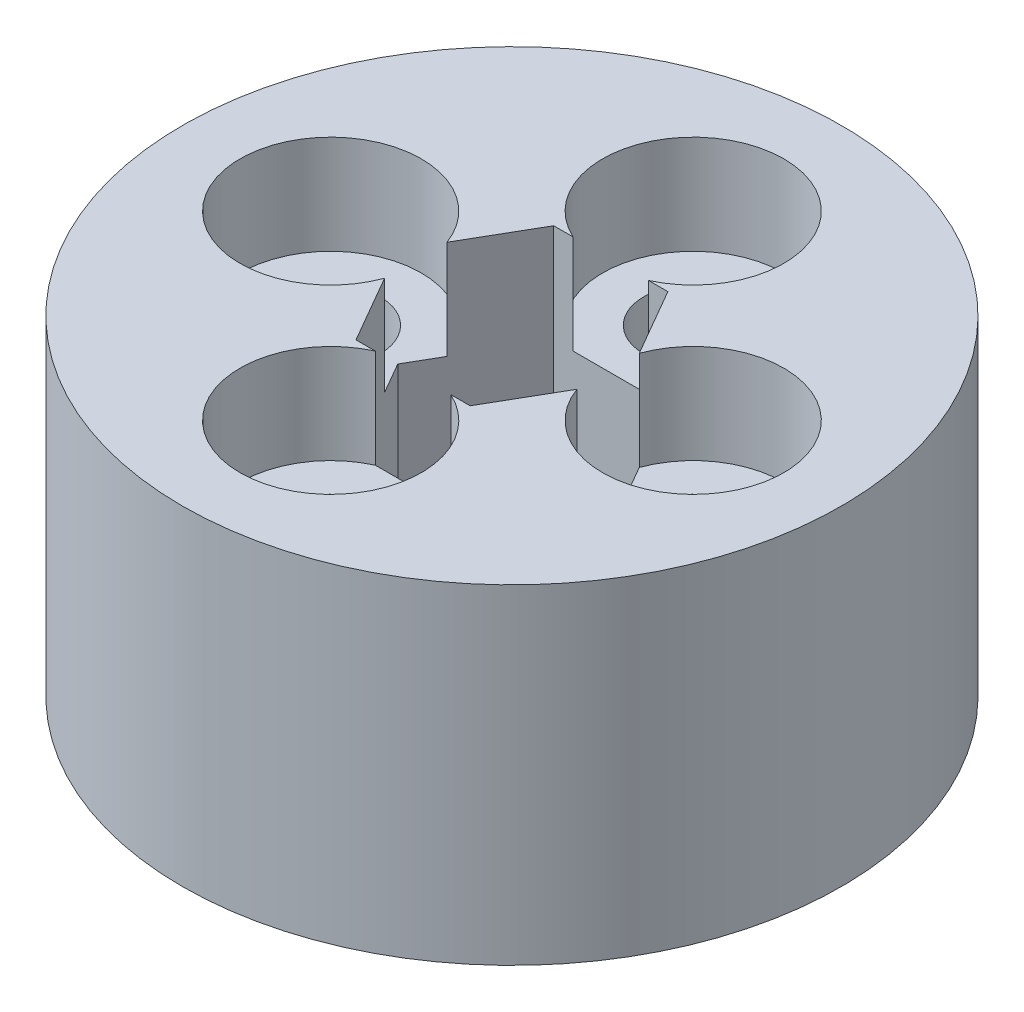
ISO-10303-21;
HEADER;
FILE_DESCRIPTION(('STEP AP214'),'2;1');
FILE_NAME('part.step','',(''),(''),'','','');
FILE_SCHEMA(('AUTOMOTIVE_DESIGN { 1 0 10303 214 1 1 1 1 }'));
ENDSEC;
DATA;
#1=APPLICATION_CONTEXT('core data for automotive mechanical design processes');
#2=APPLICATION_PROTOCOL_DEFINITION('international standard','automotive_design',2000,#1);
#3=PRODUCT_CONTEXT('',#1,'mechanical');
#4=PRODUCT('Part','Part','',(#3));
#5=PRODUCT_RELATED_PRODUCT_CATEGORY('part','',(#4));
#6=PRODUCT_DEFINITION_FORMATION('','',#4);
#7=PRODUCT_DEFINITION_CONTEXT('part definition',#1,'design');
#8=PRODUCT_DEFINITION('design','',#6,#7);
#9=PRODUCT_DEFINITION_SHAPE('','',#8);
#10=(LENGTH_UNIT() NAMED_UNIT(*) SI_UNIT(.MILLI.,.METRE.));
#11=(NAMED_UNIT(*) PLANE_ANGLE_UNIT() SI_UNIT($,.RADIAN.));
#12=(NAMED_UNIT(*) SI_UNIT($,.STERADIAN.) SOLID_ANGLE_UNIT());
#13=UNCERTAINTY_MEASURE_WITH_UNIT(LENGTH_MEASURE(1.E-05),#10,'distance_accuracy_value','');
#14=(GEOMETRIC_REPRESENTATION_CONTEXT(3) GLOBAL_UNCERTAINTY_ASSIGNED_CONTEXT((#13)) GLOBAL_UNIT_ASSIGNED_CONTEXT((#10,
#11,#12)) REPRESENTATION_CONTEXT('',''));
#15=CARTESIAN_POINT('',(0.,0.,0.));
#16=DIRECTION('',(0.,0.,1.));
#17=DIRECTION('',(1.,0.,0.));
#18=AXIS2_PLACEMENT_3D('',#15,#16,#17);
#19=CARTESIAN_POINT('',(0.,10.,-5.5));
#20=DIRECTION('',(0.,-1.,0.));
#21=DIRECTION('',(0.,0.,-1.));
#22=AXIS2_PLACEMENT_3D('',#19,#20,#21);
#23=CYLINDRICAL_SURFACE('',#22,1.5);
#24=CARTESIAN_POINT('',(0.,0.,-5.5));
#25=DIRECTION('',(0.,1.,0.));
#26=DIRECTION('',(0.,0.,1.));
#27=AXIS2_PLACEMENT_3D('',#24,#25,#26);
#28=CIRCLE('',#27,1.5);
#29=CARTESIAN_POINT('',(0.,0.,-4.));
#30=VERTEX_POINT('',#29);
#31=EDGE_CURVE('E253',#30,#30,#28,.T.);
#32=ORIENTED_EDGE('',*,*,#31,.F.);
#33=EDGE_LOOP('',(#32));
#34=FACE_BOUND('',#33,.T.);
#35=CARTESIAN_POINT('',(0.,7.,-5.5));
#36=DIRECTION('',(0.,1.,0.));
#37=DIRECTION('',(0.,0.,1.));
#38=AXIS2_PLACEMENT_3D('',#35,#36,#37);
#39=CIRCLE('',#38,1.5);
#40=CARTESIAN_POINT('',(0.,7.,-4.));
#41=VERTEX_POINT('',#40);
#42=EDGE_CURVE('E247',#41,#41,#39,.T.);
#43=ORIENTED_EDGE('',*,*,#42,.T.);
#44=EDGE_LOOP('',(#43));
#45=FACE_BOUND('',#44,.T.);
#46=ADVANCED_FACE('F37',(#34,#45),#23,.F.);
#47=CARTESIAN_POINT('',(5.50000000000015,10.,-1.55309068257925E-13));
#48=DIRECTION('',(0.,-1.,0.));
#49=DIRECTION('',(0.,0.,-1.));
#50=AXIS2_PLACEMENT_3D('',#47,#48,#49);
#51=CYLINDRICAL_SURFACE('',#50,1.50000000000012);
#52=CARTESIAN_POINT('',(5.50000000000015,0.,-1.55309068257925E-13));
#53=DIRECTION('',(0.,1.,0.));
#54=DIRECTION('',(0.,0.,1.));
#55=AXIS2_PLACEMENT_3D('',#52,#53,#54);
#56=CIRCLE('',#55,1.50000000000012);
#57=CARTESIAN_POINT('',(5.50000000000015,0.,1.49999999999997));
#58=VERTEX_POINT('',#57);
#59=EDGE_CURVE('E250',#58,#58,#56,.T.);
#60=ORIENTED_EDGE('',*,*,#59,.F.);
#61=EDGE_LOOP('',(#60));
#62=FACE_BOUND('',#61,.T.);
#63=CARTESIAN_POINT('',(5.50000000000015,7.,-1.55309068257925E-13));
#64=DIRECTION('',(0.,1.,0.));
#65=DIRECTION('',(0.,0.,1.));
#66=AXIS2_PLACEMENT_3D('',#63,#64,#65);
#67=CIRCLE('',#66,1.50000000000012);
#68=CARTESIAN_POINT('',(5.50000000000015,7.,1.49999999999997));
#69=VERTEX_POINT('',#68);
#70=EDGE_CURVE('E268',#69,#69,#67,.T.);
#71=ORIENTED_EDGE('',*,*,#70,.T.);
#72=EDGE_LOOP('',(#71));
#73=FACE_BOUND('',#72,.T.);
#74=ADVANCED_FACE('F332',(#62,#73),#51,.F.);
#75=CARTESIAN_POINT('',(3.10618136515851E-13,10.,5.5));
#76=DIRECTION('',(0.,-1.,0.));
#77=DIRECTION('',(0.,0.,-1.));
#78=AXIS2_PLACEMENT_3D('',#75,#76,#77);
#79=CYLINDRICAL_SURFACE('',#78,1.50000000000033);
#80=CARTESIAN_POINT('',(3.10618136515851E-13,0.,5.5));
#81=DIRECTION('',(0.,1.,0.));
#82=DIRECTION('',(0.,0.,1.));
#83=AXIS2_PLACEMENT_3D('',#80,#81,#82);
#84=CIRCLE('',#83,1.50000000000033);
#85=CARTESIAN_POINT('',(3.10618136515851E-13,0.,7.00000000000033));
#86=VERTEX_POINT('',#85);
#87=EDGE_CURVE('E246',#86,#86,#84,.T.);
#88=ORIENTED_EDGE('',*,*,#87,.F.);
#89=EDGE_LOOP('',(#88));
#90=FACE_BOUND('',#89,.T.);
#91=CARTESIAN_POINT('',(3.10618136515851E-13,7.,5.5));
#92=DIRECTION('',(0.,1.,0.));
#93=DIRECTION('',(0.,0.,1.));
#94=AXIS2_PLACEMENT_3D('',#91,#92,#93);
#95=CIRCLE('',#94,1.50000000000033);
#96=CARTESIAN_POINT('',(3.10618136515851E-13,7.,7.00000000000033));
#97=VERTEX_POINT('',#96);
#98=EDGE_CURVE('E265',#97,#97,#95,.T.);
#99=ORIENTED_EDGE('',*,*,#98,.T.);
#100=EDGE_LOOP('',(#99));
#101=FACE_BOUND('',#100,.T.);
#102=ADVANCED_FACE('F338',(#90,#101),#79,.F.);
#103=CARTESIAN_POINT('',(-5.49999999999984,10.,1.55982623997457E-13));
#104=DIRECTION('',(0.,-1.,0.));
#105=DIRECTION('',(0.,0.,-1.));
#106=AXIS2_PLACEMENT_3D('',#103,#104,#105);
#107=CYLINDRICAL_SURFACE('',#106,1.50000000000025);
#108=CARTESIAN_POINT('',(-5.49999999999984,0.,1.55982623997457E-13));
#109=DIRECTION('',(0.,1.,0.));
#110=DIRECTION('',(0.,0.,1.));
#111=AXIS2_PLACEMENT_3D('',#108,#109,#110);
#112=CIRCLE('',#111,1.50000000000025);
#113=CARTESIAN_POINT('',(-5.49999999999984,0.,1.50000000000041));
#114=VERTEX_POINT('',#113);
#115=EDGE_CURVE('E243',#114,#114,#112,.T.);
#116=ORIENTED_EDGE('',*,*,#115,.F.);
#117=EDGE_LOOP('',(#116));
#118=FACE_BOUND('',#117,.T.);
#119=CARTESIAN_POINT('',(-5.49999999999984,7.,1.55982623997457E-13));
#120=DIRECTION('',(0.,1.,0.));
#121=DIRECTION('',(0.,0.,1.));
#122=AXIS2_PLACEMENT_3D('',#119,#120,#121);
#123=CIRCLE('',#122,1.50000000000025);
#124=CARTESIAN_POINT('',(-5.49999999999984,7.,1.50000000000041));
#125=VERTEX_POINT('',#124);
#126=EDGE_CURVE('E240',#125,#125,#123,.T.);
#127=ORIENTED_EDGE('',*,*,#126,.T.);
#128=EDGE_LOOP('',(#127));
#129=FACE_BOUND('',#128,.T.);
#130=ADVANCED_FACE('F346',(#118,#129),#107,.F.);
#131=CARTESIAN_POINT('',(0.,10.,0.));
#132=DIRECTION('',(0.,1.,0.));
#133=DIRECTION('',(0.,0.,1.));
#134=AXIS2_PLACEMENT_3D('',#131,#132,#133);
#135=PLANE('',#134);
#136=DIRECTION('',(0.5,0.,-0.866025403784439));
#137=VECTOR('',#136,1.);
#138=CARTESIAN_POINT('',(1.73205080756888,10.,3.));
#139=LINE('',#138,#137);
#140=CARTESIAN_POINT('',(1.73205080756888,10.,3.));
#141=VERTEX_POINT('',#140);
#142=CARTESIAN_POINT('',(2.91787026878973,10.,0.946100444561537));
#143=VERTEX_POINT('',#142);
#144=EDGE_CURVE('E175',#141,#143,#139,.T.);
#145=ORIENTED_EDGE('',*,*,#144,.F.);
#146=DIRECTION('',(1.,0.,0.));
#147=VECTOR('',#146,1.);
#148=CARTESIAN_POINT('',(-1.73205080756888,10.,3.));
#149=LINE('',#148,#147);
#150=CARTESIAN_POINT('',(1.14564392374007,10.,3.));
#151=VERTEX_POINT('',#150);
#152=EDGE_CURVE('E165',#151,#141,#149,.T.);
#153=ORIENTED_EDGE('',*,*,#152,.F.);
#154=CARTESIAN_POINT('',(3.10618136515851E-13,10.,5.5));
#155=DIRECTION('',(0.,1.,0.));
#156=DIRECTION('',(0.,0.,1.));
#157=AXIS2_PLACEMENT_3D('',#154,#155,#156);
#158=CIRCLE('',#157,2.75000000000033);
#159=CARTESIAN_POINT('',(-1.14564392373945,10.,3.));
#160=VERTEX_POINT('',#159);
#161=EDGE_CURVE('E225',#160,#151,#158,.T.);
#162=ORIENTED_EDGE('',*,*,#161,.F.);
#163=CARTESIAN_POINT('',(-1.73205080756888,10.,3.));
#164=VERTEX_POINT('',#163);
#165=EDGE_CURVE('E163',#164,#160,#149,.T.);
#166=ORIENTED_EDGE('',*,*,#165,.F.);
#167=DIRECTION('',(0.5,0.,0.866025403784438));
#168=VECTOR('',#167,1.);
#169=CARTESIAN_POINT('',(-3.46410161513776,10.,0.));
#170=LINE('',#169,#168);
#171=CARTESIAN_POINT('',(-2.91787026878938,10.,0.946100444562131));
#172=VERTEX_POINT('',#171);
#173=EDGE_CURVE('E184',#172,#164,#170,.T.);
#174=ORIENTED_EDGE('',*,*,#173,.F.);
#175=CARTESIAN_POINT('',(-5.49999999999984,10.,1.55982623997457E-13));
#176=DIRECTION('',(0.,1.,0.));
#177=DIRECTION('',(0.,0.,1.));
#178=AXIS2_PLACEMENT_3D('',#175,#176,#177);
#179=CIRCLE('',#178,2.75000000000025);
#180=CARTESIAN_POINT('',(-2.91787026878945,10.,-0.94610044456201));
#181=VERTEX_POINT('',#180);
#182=EDGE_CURVE('E219',#181,#172,#179,.T.);
#183=ORIENTED_EDGE('',*,*,#182,.F.);
#184=DIRECTION('',(-0.5,0.,0.866025403784439));
#185=VECTOR('',#184,1.);
#186=CARTESIAN_POINT('',(-1.73205080756888,10.,-3.));
#187=LINE('',#186,#185);
#188=CARTESIAN_POINT('',(-1.73205080756888,10.,-3.));
#189=VERTEX_POINT('',#188);
#190=EDGE_CURVE('E182',#189,#181,#187,.T.);
#191=ORIENTED_EDGE('',*,*,#190,.F.);
#192=DIRECTION('',(-1.,0.,0.));
#193=VECTOR('',#192,1.);
#194=CARTESIAN_POINT('',(1.73205080756888,10.,-3.));
#195=LINE('',#194,#193);
#196=CARTESIAN_POINT('',(-1.14564392373896,10.,-3.));
#197=VERTEX_POINT('',#196);
#198=EDGE_CURVE('E179',#197,#189,#195,.T.);
#199=ORIENTED_EDGE('',*,*,#198,.F.);
#200=CARTESIAN_POINT('',(0.,10.,-5.5));
#201=DIRECTION('',(0.,1.,0.));
#202=DIRECTION('',(0.,0.,1.));
#203=AXIS2_PLACEMENT_3D('',#200,#201,#202);
#204=CIRCLE('',#203,2.75);
#205=CARTESIAN_POINT('',(1.14564392373896,10.,-3.));
#206=VERTEX_POINT('',#205);
#207=EDGE_CURVE('E234',#206,#197,#204,.T.);
#208=ORIENTED_EDGE('',*,*,#207,.F.);
#209=CARTESIAN_POINT('',(1.73205080756888,10.,-3.));
#210=VERTEX_POINT('',#209);
#211=EDGE_CURVE('E180',#210,#206,#195,.T.);
#212=ORIENTED_EDGE('',*,*,#211,.F.);
#213=DIRECTION('',(-0.5,0.,-0.866025403784438));
#214=VECTOR('',#213,1.);
#215=CARTESIAN_POINT('',(3.46410161513775,10.,0.));
#216=LINE('',#215,#214);
#217=CARTESIAN_POINT('',(2.91787026878966,10.,-0.946100444561658));
#218=VERTEX_POINT('',#217);
#219=EDGE_CURVE('E177',#218,#210,#216,.T.);
#220=ORIENTED_EDGE('',*,*,#219,.F.);
#221=CARTESIAN_POINT('',(5.50000000000015,10.,-1.55309068257925E-13));
#222=DIRECTION('',(0.,1.,0.));
#223=DIRECTION('',(0.,0.,1.));
#224=AXIS2_PLACEMENT_3D('',#221,#222,#223);
#225=CIRCLE('',#224,2.75000000000012);
#226=EDGE_CURVE('E231',#143,#218,#225,.T.);
#227=ORIENTED_EDGE('',*,*,#226,.F.);
#228=EDGE_LOOP('',(#145,#153,#162,#166,#174,#183,#191,#199,#208,#212,#220,#227));
#229=FACE_BOUND('',#228,.T.);
#230=CARTESIAN_POINT('',(0.,10.,0.));
#231=DIRECTION('',(0.,1.,0.));
#232=DIRECTION('',(0.,0.,1.));
#233=AXIS2_PLACEMENT_3D('',#230,#231,#232);
#234=CIRCLE('',#233,10.);
#235=CARTESIAN_POINT('',(0.,10.,10.));
#236=VERTEX_POINT('',#235);
#237=EDGE_CURVE('E257',#236,#236,#234,.T.);
#238=ORIENTED_EDGE('',*,*,#237,.T.);
#239=EDGE_LOOP('',(#238));
#240=FACE_BOUND('',#239,.T.);
#241=ADVANCED_FACE('F295',(#229,#240),#135,.T.);
#242=CARTESIAN_POINT('',(0.,0.,0.));
#243=DIRECTION('',(0.,1.,0.));
#244=DIRECTION('',(0.,0.,1.));
#245=AXIS2_PLACEMENT_3D('',#242,#243,#244);
#246=PLANE('',#245);
#247=CARTESIAN_POINT('',(0.,0.,0.));
#248=DIRECTION('',(0.,1.,0.));
#249=DIRECTION('',(0.,0.,1.));
#250=AXIS2_PLACEMENT_3D('',#247,#248,#249);
#251=CIRCLE('',#250,10.);
#252=CARTESIAN_POINT('',(0.,0.,10.));
#253=VERTEX_POINT('',#252);
#254=EDGE_CURVE('E256',#253,#253,#251,.T.);
#255=ORIENTED_EDGE('',*,*,#254,.F.);
#256=EDGE_LOOP('',(#255));
#257=FACE_BOUND('',#256,.T.);
#258=ORIENTED_EDGE('',*,*,#31,.T.);
#259=EDGE_LOOP('',(#258));
#260=FACE_BOUND('',#259,.T.);
#261=ORIENTED_EDGE('',*,*,#59,.T.);
#262=EDGE_LOOP('',(#261));
#263=FACE_BOUND('',#262,.T.);
#264=ORIENTED_EDGE('',*,*,#87,.T.);
#265=EDGE_LOOP('',(#264));
#266=FACE_BOUND('',#265,.T.);
#267=ORIENTED_EDGE('',*,*,#115,.T.);
#268=EDGE_LOOP('',(#267));
#269=FACE_BOUND('',#268,.T.);
#270=ADVANCED_FACE('F345',(#257,#260,#263,#266,#269),#246,.F.);
#271=CARTESIAN_POINT('',(0.,10.,0.));
#272=DIRECTION('',(0.,-1.,0.));
#273=DIRECTION('',(0.,0.,-1.));
#274=AXIS2_PLACEMENT_3D('',#271,#272,#273);
#275=CYLINDRICAL_SURFACE('',#274,10.);
#276=ORIENTED_EDGE('',*,*,#237,.F.);
#277=EDGE_LOOP('',(#276));
#278=FACE_BOUND('',#277,.T.);
#279=ORIENTED_EDGE('',*,*,#254,.T.);
#280=EDGE_LOOP('',(#279));
#281=FACE_BOUND('',#280,.T.);
#282=ADVANCED_FACE('F39',(#278,#281),#275,.T.);
#283=CARTESIAN_POINT('',(-5.49999999999984,7.,1.55982623997457E-13));
#284=DIRECTION('',(0.,1.,0.));
#285=DIRECTION('',(0.,0.,1.));
#286=AXIS2_PLACEMENT_3D('',#283,#284,#285);
#287=CYLINDRICAL_SURFACE('',#286,2.75000000000025);
#288=ORIENTED_EDGE('',*,*,#182,.T.);
#289=DIRECTION('',(0.,1.,0.));
#290=VECTOR('',#289,1.);
#291=CARTESIAN_POINT('',(-2.91787026878938,7.,0.946100444562131));
#292=LINE('',#291,#290);
#293=CARTESIAN_POINT('',(-2.91787026878938,7.,0.946100444562131));
#294=VERTEX_POINT('',#293);
#295=EDGE_CURVE('E216',#172,#294,#292,.F.);
#296=ORIENTED_EDGE('',*,*,#295,.T.);
#297=CARTESIAN_POINT('',(-5.49999999999984,7.,1.55982623997457E-13));
#298=DIRECTION('',(0.,1.,0.));
#299=DIRECTION('',(0.,0.,1.));
#300=AXIS2_PLACEMENT_3D('',#297,#298,#299);
#301=CIRCLE('',#300,2.75000000000025);
#302=CARTESIAN_POINT('',(-2.91787026878945,7.,-0.94610044456201));
#303=VERTEX_POINT('',#302);
#304=EDGE_CURVE('E218',#303,#294,#301,.T.);
#305=ORIENTED_EDGE('',*,*,#304,.F.);
#306=DIRECTION('',(0.,1.,0.));
#307=VECTOR('',#306,1.);
#308=CARTESIAN_POINT('',(-2.91787026878945,7.,-0.94610044456201));
#309=LINE('',#308,#307);
#310=EDGE_CURVE('E213',#303,#181,#309,.T.);
#311=ORIENTED_EDGE('',*,*,#310,.T.);
#312=EDGE_LOOP('',(#288,#296,#305,#311));
#313=FACE_BOUND('',#312,.T.);
#314=ADVANCED_FACE('F289',(#313),#287,.F.);
#315=CARTESIAN_POINT('',(-5.49999999999984,7.,1.55982623997457E-13));
#316=DIRECTION('',(0.,1.,0.));
#317=DIRECTION('',(0.,0.,1.));
#318=AXIS2_PLACEMENT_3D('',#315,#316,#317);
#319=PLANE('',#318);
#320=DIRECTION('',(0.5,0.,0.866025403784438));
#321=VECTOR('',#320,1.);
#322=CARTESIAN_POINT('',(-3.97307621135321,7.,-0.881569860407022));
#323=LINE('',#322,#321);
#324=CARTESIAN_POINT('',(-3.46410161513776,7.,0.));
#325=VERTEX_POINT('',#324);
#326=EDGE_CURVE('E11',#325,#294,#323,.T.);
#327=ORIENTED_EDGE('',*,*,#326,.F.);
#328=DIRECTION('',(-0.5,0.,0.866025403784439));
#329=VECTOR('',#328,1.);
#330=CARTESIAN_POINT('',(-3.97307621135335,7.,0.881569860407256));
#331=LINE('',#330,#329);
#332=EDGE_CURVE('E45',#303,#325,#331,.T.);
#333=ORIENTED_EDGE('',*,*,#332,.F.);
#334=ORIENTED_EDGE('',*,*,#304,.T.);
#335=EDGE_LOOP('',(#327,#333,#334));
#336=FACE_BOUND('',#335,.T.);
#337=ORIENTED_EDGE('',*,*,#126,.F.);
#338=EDGE_LOOP('',(#337));
#339=FACE_BOUND('',#338,.T.);
#340=ADVANCED_FACE('F286',(#336,#339),#319,.T.);
#341=CARTESIAN_POINT('',(3.10618136515851E-13,7.,5.5));
#342=DIRECTION('',(0.,1.,0.));
#343=DIRECTION('',(0.,0.,1.));
#344=AXIS2_PLACEMENT_3D('',#341,#342,#343);
#345=CYLINDRICAL_SURFACE('',#344,2.75000000000033);
#346=ORIENTED_EDGE('',*,*,#161,.T.);
#347=DIRECTION('',(0.,1.,0.));
#348=VECTOR('',#347,1.);
#349=CARTESIAN_POINT('',(1.14564392374007,7.,3.));
#350=LINE('',#349,#348);
#351=CARTESIAN_POINT('',(1.14564392374007,7.,3.));
#352=VERTEX_POINT('',#351);
#353=EDGE_CURVE('E210',#151,#352,#350,.F.);
#354=ORIENTED_EDGE('',*,*,#353,.T.);
#355=CARTESIAN_POINT('',(3.10618136515851E-13,7.,5.5));
#356=DIRECTION('',(0.,1.,0.));
#357=DIRECTION('',(0.,0.,1.));
#358=AXIS2_PLACEMENT_3D('',#355,#356,#357);
#359=CIRCLE('',#358,2.75000000000033);
#360=CARTESIAN_POINT('',(-1.14564392373945,7.,3.));
#361=VERTEX_POINT('',#360);
#362=EDGE_CURVE('E222',#361,#352,#359,.T.);
#363=ORIENTED_EDGE('',*,*,#362,.F.);
#364=DIRECTION('',(0.,1.,0.));
#365=VECTOR('',#364,1.);
#366=CARTESIAN_POINT('',(-1.14564392373945,7.,3.));
#367=LINE('',#366,#365);
#368=EDGE_CURVE('E207',#361,#160,#367,.T.);
#369=ORIENTED_EDGE('',*,*,#368,.T.);
#370=EDGE_LOOP('',(#346,#354,#363,#369));
#371=FACE_BOUND('',#370,.T.);
#372=ADVANCED_FACE('F305',(#371),#345,.F.);
#373=CARTESIAN_POINT('',(3.10618136515851E-13,7.,5.5));
#374=DIRECTION('',(0.,1.,0.));
#375=DIRECTION('',(0.,0.,1.));
#376=AXIS2_PLACEMENT_3D('',#373,#374,#375);
#377=PLANE('',#376);
#378=DIRECTION('',(1.,0.,0.));
#379=VECTOR('',#378,1.);
#380=CARTESIAN_POINT('',(3.11244100931991E-13,7.,3.));
#381=LINE('',#380,#379);
#382=EDGE_CURVE('E277',#361,#352,#381,.T.);
#383=ORIENTED_EDGE('',*,*,#382,.F.);
#384=ORIENTED_EDGE('',*,*,#362,.T.);
#385=EDGE_LOOP('',(#383,#384));
#386=FACE_BOUND('',#385,.T.);
#387=ORIENTED_EDGE('',*,*,#98,.F.);
#388=EDGE_LOOP('',(#387));
#389=FACE_BOUND('',#388,.T.);
#390=ADVANCED_FACE('F307',(#386,#389),#377,.T.);
#391=CARTESIAN_POINT('',(5.50000000000015,7.,-1.55309068257925E-13));
#392=DIRECTION('',(0.,1.,0.));
#393=DIRECTION('',(0.,0.,1.));
#394=AXIS2_PLACEMENT_3D('',#391,#392,#393);
#395=CYLINDRICAL_SURFACE('',#394,2.75000000000012);
#396=CARTESIAN_POINT('',(5.50000000000015,7.,-1.55309068257925E-13));
#397=DIRECTION('',(0.,1.,0.));
#398=DIRECTION('',(0.,0.,1.));
#399=AXIS2_PLACEMENT_3D('',#396,#397,#398);
#400=CIRCLE('',#399,2.75000000000012);
#401=CARTESIAN_POINT('',(2.91787026878973,7.,0.946100444561537));
#402=VERTEX_POINT('',#401);
#403=CARTESIAN_POINT('',(2.91787026878966,7.,-0.946100444561658));
#404=VERTEX_POINT('',#403);
#405=EDGE_CURVE('E228',#402,#404,#400,.T.);
#406=ORIENTED_EDGE('',*,*,#405,.F.);
#407=DIRECTION('',(0.,1.,0.));
#408=VECTOR('',#407,1.);
#409=CARTESIAN_POINT('',(2.91787026878973,7.,0.946100444561538));
#410=LINE('',#409,#408);
#411=EDGE_CURVE('E204',#402,#143,#410,.T.);
#412=ORIENTED_EDGE('',*,*,#411,.T.);
#413=ORIENTED_EDGE('',*,*,#226,.T.);
#414=DIRECTION('',(0.,1.,0.));
#415=VECTOR('',#414,1.);
#416=CARTESIAN_POINT('',(2.91787026878966,7.,-0.946100444561658));
#417=LINE('',#416,#415);
#418=EDGE_CURVE('E201',#218,#404,#417,.F.);
#419=ORIENTED_EDGE('',*,*,#418,.T.);
#420=EDGE_LOOP('',(#406,#412,#413,#419));
#421=FACE_BOUND('',#420,.T.);
#422=ADVANCED_FACE('F313',(#421),#395,.F.);
#423=CARTESIAN_POINT('',(5.50000000000015,7.,-1.55309068257925E-13));
#424=DIRECTION('',(0.,1.,0.));
#425=DIRECTION('',(0.,0.,1.));
#426=AXIS2_PLACEMENT_3D('',#423,#424,#425);
#427=PLANE('',#426);
#428=DIRECTION('',(0.5,0.,-0.866025403784439));
#429=VECTOR('',#428,1.);
#430=CARTESIAN_POINT('',(3.97307621135342,7.,-0.881569860407389));
#431=LINE('',#430,#429);
#432=CARTESIAN_POINT('',(3.46410161513775,7.,0.));
#433=VERTEX_POINT('',#432);
#434=EDGE_CURVE('E145',#402,#433,#431,.T.);
#435=ORIENTED_EDGE('',*,*,#434,.F.);
#436=ORIENTED_EDGE('',*,*,#405,.T.);
#437=DIRECTION('',(-0.5,0.,-0.866025403784438));
#438=VECTOR('',#437,1.);
#439=CARTESIAN_POINT('',(3.97307621135329,7.,0.881569860407157));
#440=LINE('',#439,#438);
#441=EDGE_CURVE('E274',#433,#404,#440,.T.);
#442=ORIENTED_EDGE('',*,*,#441,.F.);
#443=EDGE_LOOP('',(#435,#436,#442));
#444=FACE_BOUND('',#443,.T.);
#445=ORIENTED_EDGE('',*,*,#70,.F.);
#446=EDGE_LOOP('',(#445));
#447=FACE_BOUND('',#446,.T.);
#448=ADVANCED_FACE('F315',(#444,#447),#427,.T.);
#449=CARTESIAN_POINT('',(0.,7.,-5.5));
#450=DIRECTION('',(0.,1.,0.));
#451=DIRECTION('',(0.,0.,1.));
#452=AXIS2_PLACEMENT_3D('',#449,#450,#451);
#453=CYLINDRICAL_SURFACE('',#452,2.75);
#454=ORIENTED_EDGE('',*,*,#207,.T.);
#455=DIRECTION('',(0.,1.,0.));
#456=VECTOR('',#455,1.);
#457=CARTESIAN_POINT('',(-1.14564392373896,7.,-3.));
#458=LINE('',#457,#456);
#459=CARTESIAN_POINT('',(-1.14564392373896,7.,-3.));
#460=VERTEX_POINT('',#459);
#461=EDGE_CURVE('E198',#197,#460,#458,.F.);
#462=ORIENTED_EDGE('',*,*,#461,.T.);
#463=CARTESIAN_POINT('',(0.,7.,-5.5));
#464=DIRECTION('',(0.,1.,0.));
#465=DIRECTION('',(0.,0.,1.));
#466=AXIS2_PLACEMENT_3D('',#463,#464,#465);
#467=CIRCLE('',#466,2.75);
#468=CARTESIAN_POINT('',(1.14564392373896,7.,-3.));
#469=VERTEX_POINT('',#468);
#470=EDGE_CURVE('E237',#469,#460,#467,.T.);
#471=ORIENTED_EDGE('',*,*,#470,.F.);
#472=DIRECTION('',(0.,1.,0.));
#473=VECTOR('',#472,1.);
#474=CARTESIAN_POINT('',(1.14564392373896,7.,-3.));
#475=LINE('',#474,#473);
#476=EDGE_CURVE('E52',#469,#206,#475,.T.);
#477=ORIENTED_EDGE('',*,*,#476,.T.);
#478=EDGE_LOOP('',(#454,#462,#471,#477));
#479=FACE_BOUND('',#478,.T.);
#480=ADVANCED_FACE('F323',(#479),#453,.F.);
#481=CARTESIAN_POINT('',(0.,7.,-5.5));
#482=DIRECTION('',(0.,1.,0.));
#483=DIRECTION('',(0.,0.,1.));
#484=AXIS2_PLACEMENT_3D('',#481,#482,#483);
#485=PLANE('',#484);
#486=DIRECTION('',(-1.,0.,0.));
#487=VECTOR('',#486,1.);
#488=CARTESIAN_POINT('',(0.,7.,-3.));
#489=LINE('',#488,#487);
#490=EDGE_CURVE('E260',#469,#460,#489,.T.);
#491=ORIENTED_EDGE('',*,*,#490,.F.);
#492=ORIENTED_EDGE('',*,*,#470,.T.);
#493=EDGE_LOOP('',(#491,#492));
#494=FACE_BOUND('',#493,.T.);
#495=ORIENTED_EDGE('',*,*,#42,.F.);
#496=EDGE_LOOP('',(#495));
#497=FACE_BOUND('',#496,.T.);
#498=ADVANCED_FACE('F325',(#494,#497),#485,.T.);
#499=CARTESIAN_POINT('',(-3.46410161513776,3.,0.));
#500=DIRECTION('',(-0.866025403784438,0.,0.5));
#501=DIRECTION('',(0.5,0.,0.866025403784438));
#502=AXIS2_PLACEMENT_3D('',#499,#500,#501);
#503=PLANE('',#502);
#504=ORIENTED_EDGE('',*,*,#173,.T.);
#505=DIRECTION('',(0.,1.,0.));
#506=VECTOR('',#505,1.);
#507=CARTESIAN_POINT('',(-1.73205080756888,3.,3.));
#508=LINE('',#507,#506);
#509=CARTESIAN_POINT('',(-1.73205080756888,3.,3.));
#510=VERTEX_POINT('',#509);
#511=EDGE_CURVE('E188',#510,#164,#508,.T.);
#512=ORIENTED_EDGE('',*,*,#511,.F.);
#513=DIRECTION('',(0.5,0.,0.866025403784438));
#514=VECTOR('',#513,1.);
#515=CARTESIAN_POINT('',(-3.46410161513776,3.,0.));
#516=LINE('',#515,#514);
#517=CARTESIAN_POINT('',(-3.46410161513776,3.,0.));
#518=VERTEX_POINT('',#517);
#519=EDGE_CURVE('E172',#518,#510,#516,.T.);
#520=ORIENTED_EDGE('',*,*,#519,.F.);
#521=DIRECTION('',(0.,1.,0.));
#522=VECTOR('',#521,1.);
#523=CARTESIAN_POINT('',(-3.46410161513776,3.,0.));
#524=LINE('',#523,#522);
#525=EDGE_CURVE('E191',#518,#325,#524,.T.);
#526=ORIENTED_EDGE('',*,*,#525,.T.);
#527=ORIENTED_EDGE('',*,*,#326,.T.);
#528=ORIENTED_EDGE('',*,*,#295,.F.);
#529=EDGE_LOOP('',(#504,#512,#520,#526,#527,#528));
#530=FACE_BOUND('',#529,.T.);
#531=ADVANCED_FACE('F285',(#530),#503,.F.);
#532=CARTESIAN_POINT('',(-1.73205080756888,3.,-3.));
#533=DIRECTION('',(-0.866025403784438,0.,-0.5));
#534=DIRECTION('',(-0.5,0.,0.866025403784439));
#535=AXIS2_PLACEMENT_3D('',#532,#533,#534);
#536=PLANE('',#535);
#537=ORIENTED_EDGE('',*,*,#332,.T.);
#538=ORIENTED_EDGE('',*,*,#525,.F.);
#539=DIRECTION('',(-0.5,0.,0.866025403784439));
#540=VECTOR('',#539,1.);
#541=CARTESIAN_POINT('',(-1.73205080756888,3.,-3.));
#542=LINE('',#541,#540);
#543=CARTESIAN_POINT('',(-1.73205080756888,3.,-3.));
#544=VERTEX_POINT('',#543);
#545=EDGE_CURVE('E169',#544,#518,#542,.T.);
#546=ORIENTED_EDGE('',*,*,#545,.F.);
#547=DIRECTION('',(0.,1.,0.));
#548=VECTOR('',#547,1.);
#549=CARTESIAN_POINT('',(-1.73205080756888,3.,-3.));
#550=LINE('',#549,#548);
#551=EDGE_CURVE('E193',#544,#189,#550,.T.);
#552=ORIENTED_EDGE('',*,*,#551,.T.);
#553=ORIENTED_EDGE('',*,*,#190,.T.);
#554=ORIENTED_EDGE('',*,*,#310,.F.);
#555=EDGE_LOOP('',(#537,#538,#546,#552,#553,#554));
#556=FACE_BOUND('',#555,.T.);
#557=ADVANCED_FACE('F280',(#556),#536,.F.);
#558=CARTESIAN_POINT('',(-1.73205080756888,3.,3.));
#559=DIRECTION('',(0.,0.,1.));
#560=DIRECTION('',(1.,0.,0.));
#561=AXIS2_PLACEMENT_3D('',#558,#559,#560);
#562=PLANE('',#561);
#563=ORIENTED_EDGE('',*,*,#152,.T.);
#564=DIRECTION('',(0.,1.,0.));
#565=VECTOR('',#564,1.);
#566=CARTESIAN_POINT('',(1.73205080756888,3.,3.));
#567=LINE('',#566,#565);
#568=CARTESIAN_POINT('',(1.73205080756888,3.,3.));
#569=VERTEX_POINT('',#568);
#570=EDGE_CURVE('E186',#569,#141,#567,.T.);
#571=ORIENTED_EDGE('',*,*,#570,.F.);
#572=DIRECTION('',(1.,0.,0.));
#573=VECTOR('',#572,1.);
#574=CARTESIAN_POINT('',(-1.73205080756888,3.,3.));
#575=LINE('',#574,#573);
#576=EDGE_CURVE('E149',#510,#569,#575,.T.);
#577=ORIENTED_EDGE('',*,*,#576,.F.);
#578=ORIENTED_EDGE('',*,*,#511,.T.);
#579=ORIENTED_EDGE('',*,*,#165,.T.);
#580=ORIENTED_EDGE('',*,*,#368,.F.);
#581=ORIENTED_EDGE('',*,*,#382,.T.);
#582=ORIENTED_EDGE('',*,*,#353,.F.);
#583=EDGE_LOOP('',(#563,#571,#577,#578,#579,#580,#581,#582));
#584=FACE_BOUND('',#583,.T.);
#585=ADVANCED_FACE('F301',(#584),#562,.F.);
#586=CARTESIAN_POINT('',(1.73205080756888,3.,3.));
#587=DIRECTION('',(0.866025403784439,0.,0.5));
#588=DIRECTION('',(0.5,0.,-0.866025403784439));
#589=AXIS2_PLACEMENT_3D('',#586,#587,#588);
#590=PLANE('',#589);
#591=ORIENTED_EDGE('',*,*,#434,.T.);
#592=DIRECTION('',(0.,1.,0.));
#593=VECTOR('',#592,1.);
#594=CARTESIAN_POINT('',(3.46410161513775,3.,0.));
#595=LINE('',#594,#593);
#596=CARTESIAN_POINT('',(3.46410161513775,3.,0.));
#597=VERTEX_POINT('',#596);
#598=EDGE_CURVE('E137',#597,#433,#595,.T.);
#599=ORIENTED_EDGE('',*,*,#598,.F.);
#600=DIRECTION('',(0.5,0.,-0.866025403784439));
#601=VECTOR('',#600,1.);
#602=CARTESIAN_POINT('',(1.73205080756888,3.,3.));
#603=LINE('',#602,#601);
#604=EDGE_CURVE('E142',#569,#597,#603,.T.);
#605=ORIENTED_EDGE('',*,*,#604,.F.);
#606=ORIENTED_EDGE('',*,*,#570,.T.);
#607=ORIENTED_EDGE('',*,*,#144,.T.);
#608=ORIENTED_EDGE('',*,*,#411,.F.);
#609=EDGE_LOOP('',(#591,#599,#605,#606,#607,#608));
#610=FACE_BOUND('',#609,.T.);
#611=ADVANCED_FACE('F139',(#610),#590,.F.);
#612=CARTESIAN_POINT('',(3.46410161513775,3.,0.));
#613=DIRECTION('',(0.866025403784438,0.,-0.5));
#614=DIRECTION('',(-0.5,0.,-0.866025403784438));
#615=AXIS2_PLACEMENT_3D('',#612,#613,#614);
#616=PLANE('',#615);
#617=ORIENTED_EDGE('',*,*,#219,.T.);
#618=DIRECTION('',(0.,1.,0.));
#619=VECTOR('',#618,1.);
#620=CARTESIAN_POINT('',(1.73205080756888,3.,-3.));
#621=LINE('',#620,#619);
#622=CARTESIAN_POINT('',(1.73205080756888,3.,-3.));
#623=VERTEX_POINT('',#622);
#624=EDGE_CURVE('E148',#623,#210,#621,.T.);
#625=ORIENTED_EDGE('',*,*,#624,.F.);
#626=DIRECTION('',(-0.5,0.,-0.866025403784438));
#627=VECTOR('',#626,1.);
#628=CARTESIAN_POINT('',(3.46410161513775,3.,0.));
#629=LINE('',#628,#627);
#630=EDGE_CURVE('E152',#597,#623,#629,.T.);
#631=ORIENTED_EDGE('',*,*,#630,.F.);
#632=ORIENTED_EDGE('',*,*,#598,.T.);
#633=ORIENTED_EDGE('',*,*,#441,.T.);
#634=ORIENTED_EDGE('',*,*,#418,.F.);
#635=EDGE_LOOP('',(#617,#625,#631,#632,#633,#634));
#636=FACE_BOUND('',#635,.T.);
#637=ADVANCED_FACE('F153',(#636),#616,.F.);
#638=CARTESIAN_POINT('',(1.73205080756888,3.,-3.));
#639=DIRECTION('',(0.,0.,-1.));
#640=DIRECTION('',(-1.,0.,0.));
#641=AXIS2_PLACEMENT_3D('',#638,#639,#640);
#642=PLANE('',#641);
#643=ORIENTED_EDGE('',*,*,#198,.T.);
#644=ORIENTED_EDGE('',*,*,#551,.F.);
#645=DIRECTION('',(-1.,0.,0.));
#646=VECTOR('',#645,1.);
#647=CARTESIAN_POINT('',(1.73205080756888,3.,-3.));
#648=LINE('',#647,#646);
#649=EDGE_CURVE('E158',#623,#544,#648,.T.);
#650=ORIENTED_EDGE('',*,*,#649,.F.);
#651=ORIENTED_EDGE('',*,*,#624,.T.);
#652=ORIENTED_EDGE('',*,*,#211,.T.);
#653=ORIENTED_EDGE('',*,*,#476,.F.);
#654=ORIENTED_EDGE('',*,*,#490,.T.);
#655=ORIENTED_EDGE('',*,*,#461,.F.);
#656=EDGE_LOOP('',(#643,#644,#650,#651,#652,#653,#654,#655));
#657=FACE_BOUND('',#656,.T.);
#658=ADVANCED_FACE('F320',(#657),#642,.F.);
#659=CARTESIAN_POINT('',(0.,3.,0.));
#660=DIRECTION('',(0.,1.,0.));
#661=DIRECTION('',(0.,0.,1.));
#662=AXIS2_PLACEMENT_3D('',#659,#660,#661);
#663=PLANE('',#662);
#664=ORIENTED_EDGE('',*,*,#604,.T.);
#665=ORIENTED_EDGE('',*,*,#630,.T.);
#666=ORIENTED_EDGE('',*,*,#649,.T.);
#667=ORIENTED_EDGE('',*,*,#545,.T.);
#668=ORIENTED_EDGE('',*,*,#519,.T.);
#669=ORIENTED_EDGE('',*,*,#576,.T.);
#670=EDGE_LOOP('',(#664,#665,#666,#667,#668,#669));
#671=FACE_BOUND('',#670,.T.);
#672=ADVANCED_FACE('F160',(#671),#663,.T.);
#673=CLOSED_SHELL('',(#46,#74,#102,#130,#241,#270,#282,#314,#340,#372,#390,#422,#448,#480,#498,
#531,#557,#585,#611,#637,#658,#672));
#674=MANIFOLD_SOLID_BREP('B2',#673);
#675=ADVANCED_BREP_SHAPE_REPRESENTATION('',(#18,#674),#14);
#676=SHAPE_DEFINITION_REPRESENTATION(#9,#675);
ENDSEC;
END-ISO-10303-21;
